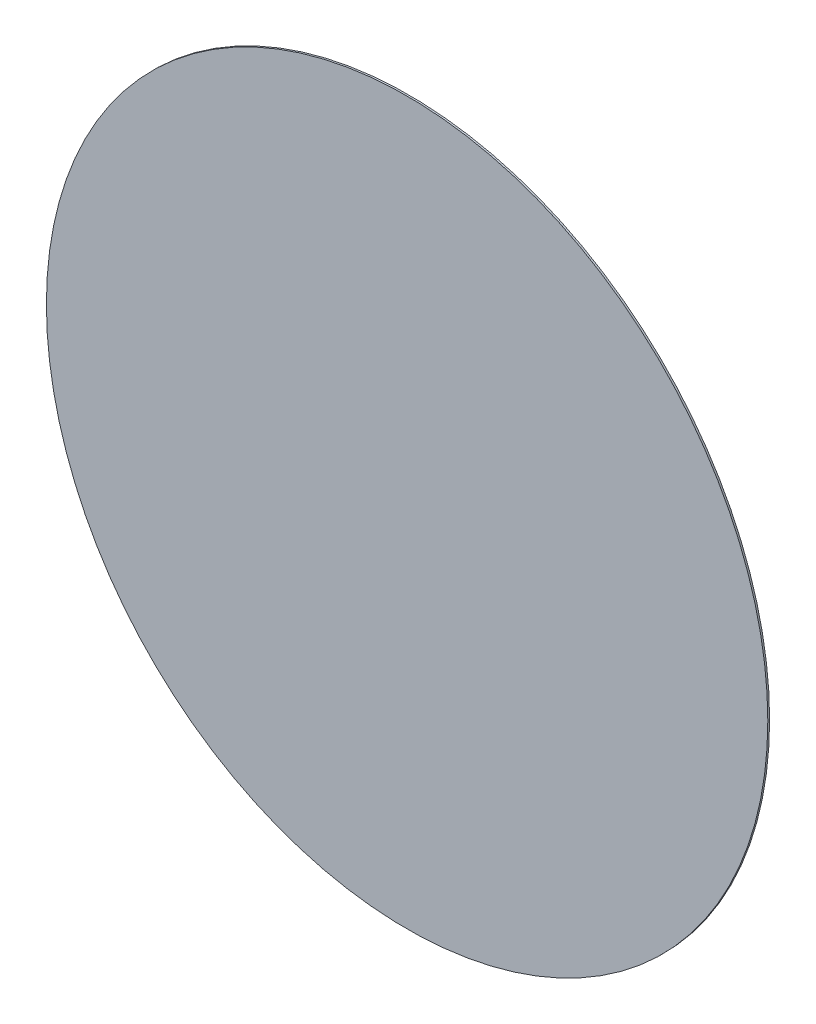
ISO-10303-21;
HEADER;
FILE_DESCRIPTION(('STEP AP214'),'2;1');
FILE_NAME('part.step','',(''),(''),'','','');
FILE_SCHEMA(('AUTOMOTIVE_DESIGN { 1 0 10303 214 1 1 1 1 }'));
ENDSEC;
DATA;
#1=APPLICATION_CONTEXT('core data for automotive mechanical design processes');
#2=APPLICATION_PROTOCOL_DEFINITION('international standard','automotive_design',2000,#1);
#3=PRODUCT_CONTEXT('',#1,'mechanical');
#4=PRODUCT('Part','Part','',(#3));
#5=PRODUCT_RELATED_PRODUCT_CATEGORY('part','',(#4));
#6=PRODUCT_DEFINITION_FORMATION('','',#4);
#7=PRODUCT_DEFINITION_CONTEXT('part definition',#1,'design');
#8=PRODUCT_DEFINITION('design','',#6,#7);
#9=PRODUCT_DEFINITION_SHAPE('','',#8);
#10=(LENGTH_UNIT() NAMED_UNIT(*) SI_UNIT(.MILLI.,.METRE.));
#11=(NAMED_UNIT(*) PLANE_ANGLE_UNIT() SI_UNIT($,.RADIAN.));
#12=(NAMED_UNIT(*) SI_UNIT($,.STERADIAN.) SOLID_ANGLE_UNIT());
#13=UNCERTAINTY_MEASURE_WITH_UNIT(LENGTH_MEASURE(1.E-05),#10,'distance_accuracy_value','');
#14=(GEOMETRIC_REPRESENTATION_CONTEXT(3) GLOBAL_UNCERTAINTY_ASSIGNED_CONTEXT((#13)) GLOBAL_UNIT_ASSIGNED_CONTEXT((#10,
#11,#12)) REPRESENTATION_CONTEXT('',''));
#15=CARTESIAN_POINT('',(0.,0.,0.));
#16=DIRECTION('',(0.,0.,1.));
#17=DIRECTION('',(1.,0.,0.));
#18=AXIS2_PLACEMENT_3D('',#15,#16,#17);
#19=CARTESIAN_POINT('',(0.,0.,0.));
#20=DIRECTION('',(0.,0.,1.));
#21=DIRECTION('',(-1.,0.,0.));
#22=AXIS2_PLACEMENT_3D('',#19,#20,#21);
#23=CYLINDRICAL_SURFACE('',#22,0.2);
#24=CARTESIAN_POINT('',(0.,0.,0.001));
#25=DIRECTION('',(0.,0.,1.));
#26=DIRECTION('',(-1.,0.,0.));
#27=AXIS2_PLACEMENT_3D('',#24,#25,#26);
#28=CIRCLE('',#27,0.2);
#29=CARTESIAN_POINT('',(0.2,0.,0.001));
#30=VERTEX_POINT('',#29);
#31=EDGE_CURVE('E11',#30,#30,#28,.T.);
#32=ORIENTED_EDGE('',*,*,#31,.F.);
#33=DIRECTION('',(0.,0.,-1.));
#34=VECTOR('',#33,1.);
#35=CARTESIAN_POINT('',(0.2,0.,0.));
#36=LINE('',#35,#34);
#37=CARTESIAN_POINT('',(0.2,0.,0.));
#38=VERTEX_POINT('',#37);
#39=EDGE_CURVE('E24',#30,#38,#36,.T.);
#40=ORIENTED_EDGE('',*,*,#39,.T.);
#41=CARTESIAN_POINT('',(0.,0.,0.));
#42=DIRECTION('',(0.,0.,-1.));
#43=DIRECTION('',(-1.,0.,0.));
#44=AXIS2_PLACEMENT_3D('',#41,#42,#43);
#45=CIRCLE('',#44,0.2);
#46=EDGE_CURVE('E33',#38,#38,#45,.T.);
#47=ORIENTED_EDGE('',*,*,#46,.F.);
#48=ORIENTED_EDGE('',*,*,#39,.F.);
#49=EDGE_LOOP('',(#32,#40,#47,#48));
#50=FACE_BOUND('',#49,.T.);
#51=ADVANCED_FACE('F17',(#50),#23,.T.);
#52=CARTESIAN_POINT('',(0.,0.,0.));
#53=DIRECTION('',(0.,0.,1.));
#54=DIRECTION('',(1.,0.,0.));
#55=AXIS2_PLACEMENT_3D('',#52,#53,#54);
#56=PLANE('',#55);
#57=ORIENTED_EDGE('',*,*,#46,.T.);
#58=EDGE_LOOP('',(#57));
#59=FACE_BOUND('',#58,.T.);
#60=ADVANCED_FACE('F35',(#59),#56,.F.);
#61=CARTESIAN_POINT('',(0.,0.,0.001));
#62=DIRECTION('',(0.,0.,1.));
#63=DIRECTION('',(1.,0.,0.));
#64=AXIS2_PLACEMENT_3D('',#61,#62,#63);
#65=PLANE('',#64);
#66=ORIENTED_EDGE('',*,*,#31,.T.);
#67=EDGE_LOOP('',(#66));
#68=FACE_BOUND('',#67,.T.);
#69=ADVANCED_FACE('F38',(#68),#65,.T.);
#70=CLOSED_SHELL('',(#51,#60,#69));
#71=MANIFOLD_SOLID_BREP('B1',#70);
#72=ADVANCED_BREP_SHAPE_REPRESENTATION('',(#18,#71),#14);
#73=SHAPE_DEFINITION_REPRESENTATION(#9,#72);
ENDSEC;
END-ISO-10303-21;
